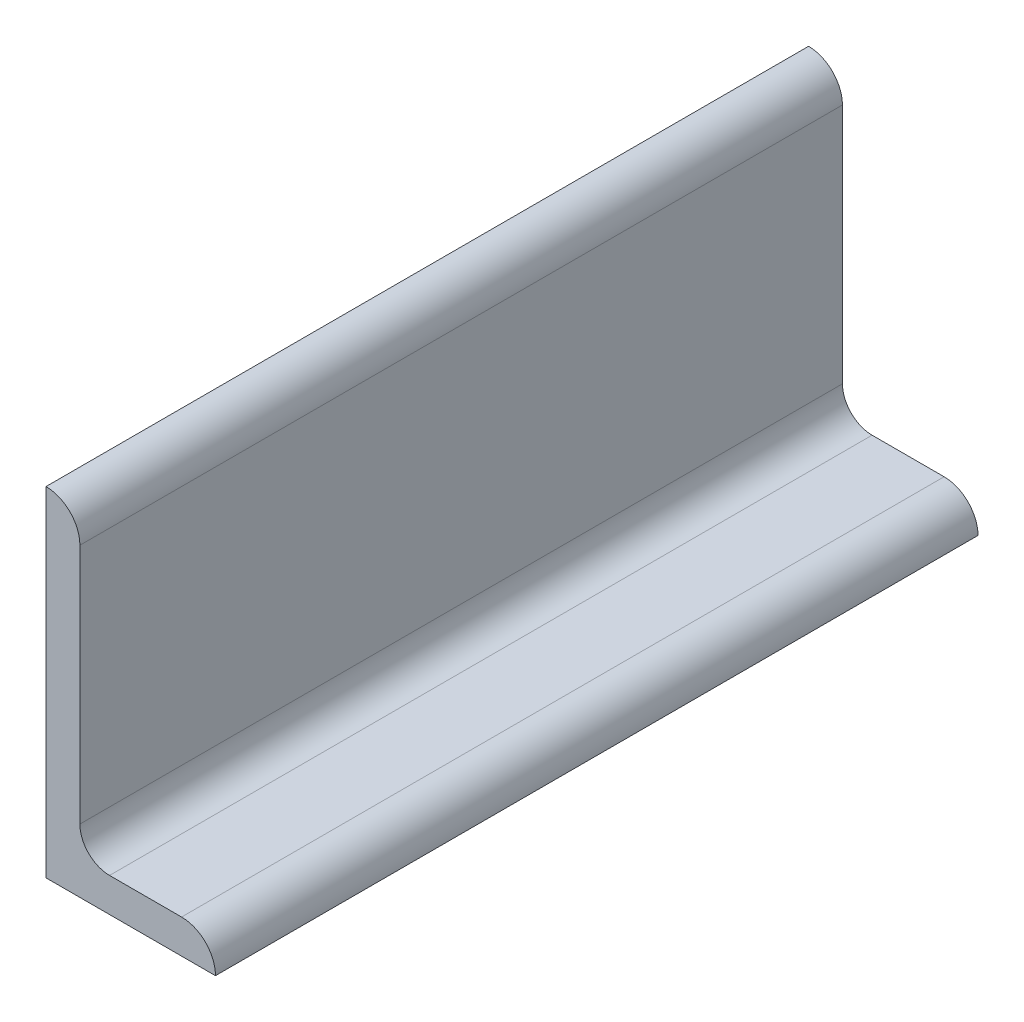
ISO-10303-21;
HEADER;
FILE_DESCRIPTION(('STEP AP214'),'2;1');
FILE_NAME('part.step','',(''),(''),'','','');
FILE_SCHEMA(('AUTOMOTIVE_DESIGN { 1 0 10303 214 1 1 1 1 }'));
ENDSEC;
DATA;
#1=APPLICATION_CONTEXT('core data for automotive mechanical design processes');
#2=APPLICATION_PROTOCOL_DEFINITION('international standard','automotive_design',2000,#1);
#3=PRODUCT_CONTEXT('',#1,'mechanical');
#4=PRODUCT('Part','Part','',(#3));
#5=PRODUCT_RELATED_PRODUCT_CATEGORY('part','',(#4));
#6=PRODUCT_DEFINITION_FORMATION('','',#4);
#7=PRODUCT_DEFINITION_CONTEXT('part definition',#1,'design');
#8=PRODUCT_DEFINITION('design','',#6,#7);
#9=PRODUCT_DEFINITION_SHAPE('','',#8);
#10=(LENGTH_UNIT() NAMED_UNIT(*) SI_UNIT(.MILLI.,.METRE.));
#11=(NAMED_UNIT(*) PLANE_ANGLE_UNIT() SI_UNIT($,.RADIAN.));
#12=(NAMED_UNIT(*) SI_UNIT($,.STERADIAN.) SOLID_ANGLE_UNIT());
#13=UNCERTAINTY_MEASURE_WITH_UNIT(LENGTH_MEASURE(1.E-05),#10,'distance_accuracy_value','');
#14=(GEOMETRIC_REPRESENTATION_CONTEXT(3) GLOBAL_UNCERTAINTY_ASSIGNED_CONTEXT((#13)) GLOBAL_UNIT_ASSIGNED_CONTEXT((#10,
#11,#12)) REPRESENTATION_CONTEXT('',''));
#15=CARTESIAN_POINT('',(0.,0.,0.));
#16=DIRECTION('',(0.,0.,1.));
#17=DIRECTION('',(1.,0.,0.));
#18=AXIS2_PLACEMENT_3D('',#15,#16,#17);
#19=CARTESIAN_POINT('',(40.,0.,90.));
#20=DIRECTION('',(0.,1.,0.));
#21=DIRECTION('',(-1.,0.,0.));
#22=AXIS2_PLACEMENT_3D('',#19,#20,#21);
#23=PLANE('',#22);
#24=DIRECTION('',(1.,0.,0.));
#25=VECTOR('',#24,1.);
#26=CARTESIAN_POINT('',(40.,0.,-90.));
#27=LINE('',#26,#25);
#28=CARTESIAN_POINT('',(0.,0.,-90.));
#29=VERTEX_POINT('',#28);
#30=CARTESIAN_POINT('',(40.,0.,-90.));
#31=VERTEX_POINT('',#30);
#32=EDGE_CURVE('E108',#29,#31,#27,.T.);
#33=ORIENTED_EDGE('',*,*,#32,.T.);
#34=DIRECTION('',(0.,0.,-1.));
#35=VECTOR('',#34,1.);
#36=CARTESIAN_POINT('',(40.,0.,90.));
#37=LINE('',#36,#35);
#38=CARTESIAN_POINT('',(40.,0.,90.));
#39=VERTEX_POINT('',#38);
#40=EDGE_CURVE('E106',#39,#31,#37,.T.);
#41=ORIENTED_EDGE('',*,*,#40,.F.);
#42=DIRECTION('',(1.,0.,0.));
#43=VECTOR('',#42,1.);
#44=CARTESIAN_POINT('',(40.,0.,90.));
#45=LINE('',#44,#43);
#46=CARTESIAN_POINT('',(0.,0.,90.));
#47=VERTEX_POINT('',#46);
#48=EDGE_CURVE('E93',#47,#39,#45,.T.);
#49=ORIENTED_EDGE('',*,*,#48,.F.);
#50=DIRECTION('',(0.,0.,-1.));
#51=VECTOR('',#50,1.);
#52=CARTESIAN_POINT('',(0.,0.,90.));
#53=LINE('',#52,#51);
#54=EDGE_CURVE('E128',#47,#29,#53,.T.);
#55=ORIENTED_EDGE('',*,*,#54,.T.);
#56=EDGE_LOOP('',(#33,#41,#49,#55));
#57=FACE_BOUND('',#56,.T.);
#58=ADVANCED_FACE('F34',(#57),#23,.F.);
#59=CARTESIAN_POINT('',(15.,8.,90.));
#60=DIRECTION('',(0.,-1.,0.));
#61=DIRECTION('',(1.,0.,0.));
#62=AXIS2_PLACEMENT_3D('',#59,#60,#61);
#63=PLANE('',#62);
#64=DIRECTION('',(-1.,0.,0.));
#65=VECTOR('',#64,1.);
#66=CARTESIAN_POINT('',(15.,8.,90.));
#67=LINE('',#66,#65);
#68=CARTESIAN_POINT('',(32.,8.,90.));
#69=VERTEX_POINT('',#68);
#70=CARTESIAN_POINT('',(15.,8.,90.));
#71=VERTEX_POINT('',#70);
#72=EDGE_CURVE('E101',#69,#71,#67,.T.);
#73=ORIENTED_EDGE('',*,*,#72,.F.);
#74=DIRECTION('',(0.,0.,-1.));
#75=VECTOR('',#74,1.);
#76=CARTESIAN_POINT('',(32.,8.,90.));
#77=LINE('',#76,#75);
#78=CARTESIAN_POINT('',(32.,8.,-90.));
#79=VERTEX_POINT('',#78);
#80=EDGE_CURVE('E11',#69,#79,#77,.T.);
#81=ORIENTED_EDGE('',*,*,#80,.T.);
#82=DIRECTION('',(-1.,0.,0.));
#83=VECTOR('',#82,1.);
#84=CARTESIAN_POINT('',(15.,8.,-90.));
#85=LINE('',#84,#83);
#86=CARTESIAN_POINT('',(15.,8.,-90.));
#87=VERTEX_POINT('',#86);
#88=EDGE_CURVE('E135',#79,#87,#85,.T.);
#89=ORIENTED_EDGE('',*,*,#88,.T.);
#90=DIRECTION('',(0.,0.,-1.));
#91=VECTOR('',#90,1.);
#92=CARTESIAN_POINT('',(15.,8.,90.));
#93=LINE('',#92,#91);
#94=EDGE_CURVE('E111',#71,#87,#93,.T.);
#95=ORIENTED_EDGE('',*,*,#94,.F.);
#96=EDGE_LOOP('',(#73,#81,#89,#95));
#97=FACE_BOUND('',#96,.T.);
#98=ADVANCED_FACE('F147',(#97),#63,.F.);
#99=CARTESIAN_POINT('',(15.,15.,90.));
#100=DIRECTION('',(0.,0.,-1.));
#101=DIRECTION('',(-1.,0.,0.));
#102=AXIS2_PLACEMENT_3D('',#99,#100,#101);
#103=CYLINDRICAL_SURFACE('',#102,7.);
#104=CARTESIAN_POINT('',(15.,15.,-90.));
#105=DIRECTION('',(0.,0.,-1.));
#106=DIRECTION('',(-1.,0.,0.));
#107=AXIS2_PLACEMENT_3D('',#104,#105,#106);
#108=CIRCLE('',#107,7.);
#109=CARTESIAN_POINT('',(8.,15.,-90.));
#110=VERTEX_POINT('',#109);
#111=EDGE_CURVE('E133',#87,#110,#108,.T.);
#112=ORIENTED_EDGE('',*,*,#111,.T.);
#113=DIRECTION('',(0.,0.,-1.));
#114=VECTOR('',#113,1.);
#115=CARTESIAN_POINT('',(8.,15.,90.));
#116=LINE('',#115,#114);
#117=CARTESIAN_POINT('',(8.,15.,90.));
#118=VERTEX_POINT('',#117);
#119=EDGE_CURVE('E122',#118,#110,#116,.T.);
#120=ORIENTED_EDGE('',*,*,#119,.F.);
#121=CARTESIAN_POINT('',(15.,15.,90.));
#122=DIRECTION('',(0.,0.,-1.));
#123=DIRECTION('',(-1.,0.,0.));
#124=AXIS2_PLACEMENT_3D('',#121,#122,#123);
#125=CIRCLE('',#124,7.);
#126=EDGE_CURVE('E141',#71,#118,#125,.T.);
#127=ORIENTED_EDGE('',*,*,#126,.F.);
#128=ORIENTED_EDGE('',*,*,#94,.T.);
#129=EDGE_LOOP('',(#112,#120,#127,#128));
#130=FACE_BOUND('',#129,.T.);
#131=ADVANCED_FACE('F151',(#130),#103,.F.);
#132=CARTESIAN_POINT('',(7.99999999999999,80.,90.));
#133=DIRECTION('',(-1.,0.,0.));
#134=DIRECTION('',(0.,-1.,0.));
#135=AXIS2_PLACEMENT_3D('',#132,#133,#134);
#136=PLANE('',#135);
#137=DIRECTION('',(0.,1.,0.));
#138=VECTOR('',#137,1.);
#139=CARTESIAN_POINT('',(7.99999999999999,80.,-90.));
#140=LINE('',#139,#138);
#141=CARTESIAN_POINT('',(7.99999999999999,72.,-90.));
#142=VERTEX_POINT('',#141);
#143=EDGE_CURVE('E131',#110,#142,#140,.T.);
#144=ORIENTED_EDGE('',*,*,#143,.T.);
#145=DIRECTION('',(0.,0.,-1.));
#146=VECTOR('',#145,1.);
#147=CARTESIAN_POINT('',(7.99999999999999,72.,90.));
#148=LINE('',#147,#146);
#149=CARTESIAN_POINT('',(7.99999999999999,72.,90.));
#150=VERTEX_POINT('',#149);
#151=EDGE_CURVE('E57',#142,#150,#148,.F.);
#152=ORIENTED_EDGE('',*,*,#151,.T.);
#153=DIRECTION('',(0.,1.,0.));
#154=VECTOR('',#153,1.);
#155=CARTESIAN_POINT('',(7.99999999999999,80.,90.));
#156=LINE('',#155,#154);
#157=EDGE_CURVE('E139',#118,#150,#156,.T.);
#158=ORIENTED_EDGE('',*,*,#157,.F.);
#159=ORIENTED_EDGE('',*,*,#119,.T.);
#160=EDGE_LOOP('',(#144,#152,#158,#159));
#161=FACE_BOUND('',#160,.T.);
#162=ADVANCED_FACE('F153',(#161),#136,.F.);
#163=CARTESIAN_POINT('',(0.,80.,90.));
#164=DIRECTION('',(1.,0.,0.));
#165=DIRECTION('',(0.,1.,0.));
#166=AXIS2_PLACEMENT_3D('',#163,#164,#165);
#167=PLANE('',#166);
#168=DIRECTION('',(0.,-1.,0.));
#169=VECTOR('',#168,1.);
#170=CARTESIAN_POINT('',(0.,80.,-90.));
#171=LINE('',#170,#169);
#172=CARTESIAN_POINT('',(0.,80.,-90.));
#173=VERTEX_POINT('',#172);
#174=EDGE_CURVE('E102',#173,#29,#171,.T.);
#175=ORIENTED_EDGE('',*,*,#174,.T.);
#176=ORIENTED_EDGE('',*,*,#54,.F.);
#177=DIRECTION('',(0.,-1.,0.));
#178=VECTOR('',#177,1.);
#179=CARTESIAN_POINT('',(0.,80.,90.));
#180=LINE('',#179,#178);
#181=CARTESIAN_POINT('',(0.,80.,90.));
#182=VERTEX_POINT('',#181);
#183=EDGE_CURVE('E97',#182,#47,#180,.T.);
#184=ORIENTED_EDGE('',*,*,#183,.F.);
#185=DIRECTION('',(0.,0.,-1.));
#186=VECTOR('',#185,1.);
#187=CARTESIAN_POINT('',(0.,80.,90.));
#188=LINE('',#187,#186);
#189=EDGE_CURVE('E125',#182,#173,#188,.T.);
#190=ORIENTED_EDGE('',*,*,#189,.T.);
#191=EDGE_LOOP('',(#175,#176,#184,#190));
#192=FACE_BOUND('',#191,.T.);
#193=ADVANCED_FACE('F160',(#192),#167,.F.);
#194=CARTESIAN_POINT('',(15.,15.,90.));
#195=DIRECTION('',(0.,0.,-1.));
#196=DIRECTION('',(-1.,0.,0.));
#197=AXIS2_PLACEMENT_3D('',#194,#195,#196);
#198=PLANE('',#197);
#199=ORIENTED_EDGE('',*,*,#157,.T.);
#200=CARTESIAN_POINT('',(0.,72.,90.));
#201=DIRECTION('',(0.,0.,-1.));
#202=DIRECTION('',(-1.,0.,0.));
#203=AXIS2_PLACEMENT_3D('',#200,#201,#202);
#204=CIRCLE('',#203,8.);
#205=EDGE_CURVE('E42',#150,#182,#204,.F.);
#206=ORIENTED_EDGE('',*,*,#205,.T.);
#207=ORIENTED_EDGE('',*,*,#183,.T.);
#208=ORIENTED_EDGE('',*,*,#48,.T.);
#209=CARTESIAN_POINT('',(32.,0.,90.));
#210=DIRECTION('',(0.,0.,-1.));
#211=DIRECTION('',(-1.,0.,0.));
#212=AXIS2_PLACEMENT_3D('',#209,#210,#211);
#213=CIRCLE('',#212,8.);
#214=EDGE_CURVE('E49',#39,#69,#213,.F.);
#215=ORIENTED_EDGE('',*,*,#214,.T.);
#216=ORIENTED_EDGE('',*,*,#72,.T.);
#217=ORIENTED_EDGE('',*,*,#126,.T.);
#218=EDGE_LOOP('',(#199,#206,#207,#208,#215,#216,#217));
#219=FACE_BOUND('',#218,.T.);
#220=ADVANCED_FACE('F95',(#219),#198,.F.);
#221=CARTESIAN_POINT('',(15.,15.,-90.));
#222=DIRECTION('',(0.,0.,-1.));
#223=DIRECTION('',(-1.,0.,0.));
#224=AXIS2_PLACEMENT_3D('',#221,#222,#223);
#225=PLANE('',#224);
#226=ORIENTED_EDGE('',*,*,#174,.F.);
#227=CARTESIAN_POINT('',(0.,72.,-90.));
#228=DIRECTION('',(0.,0.,-1.));
#229=DIRECTION('',(-1.,0.,0.));
#230=AXIS2_PLACEMENT_3D('',#227,#228,#229);
#231=CIRCLE('',#230,8.);
#232=EDGE_CURVE('E115',#173,#142,#231,.T.);
#233=ORIENTED_EDGE('',*,*,#232,.T.);
#234=ORIENTED_EDGE('',*,*,#143,.F.);
#235=ORIENTED_EDGE('',*,*,#111,.F.);
#236=ORIENTED_EDGE('',*,*,#88,.F.);
#237=CARTESIAN_POINT('',(32.,0.,-90.));
#238=DIRECTION('',(0.,0.,-1.));
#239=DIRECTION('',(-1.,0.,0.));
#240=AXIS2_PLACEMENT_3D('',#237,#238,#239);
#241=CIRCLE('',#240,8.);
#242=EDGE_CURVE('E110',#79,#31,#241,.T.);
#243=ORIENTED_EDGE('',*,*,#242,.T.);
#244=ORIENTED_EDGE('',*,*,#32,.F.);
#245=EDGE_LOOP('',(#226,#233,#234,#235,#236,#243,#244));
#246=FACE_BOUND('',#245,.T.);
#247=ADVANCED_FACE('F162',(#246),#225,.T.);
#248=CARTESIAN_POINT('',(0.,72.,90.));
#249=DIRECTION('',(0.,0.,-1.));
#250=DIRECTION('',(-1.,0.,0.));
#251=AXIS2_PLACEMENT_3D('',#248,#249,#250);
#252=CYLINDRICAL_SURFACE('',#251,8.);
#253=ORIENTED_EDGE('',*,*,#205,.F.);
#254=ORIENTED_EDGE('',*,*,#151,.F.);
#255=ORIENTED_EDGE('',*,*,#232,.F.);
#256=ORIENTED_EDGE('',*,*,#189,.F.);
#257=EDGE_LOOP('',(#253,#254,#255,#256));
#258=FACE_BOUND('',#257,.T.);
#259=ADVANCED_FACE('F157',(#258),#252,.T.);
#260=CARTESIAN_POINT('',(32.,0.,90.));
#261=DIRECTION('',(0.,0.,-1.));
#262=DIRECTION('',(-1.,0.,0.));
#263=AXIS2_PLACEMENT_3D('',#260,#261,#262);
#264=CYLINDRICAL_SURFACE('',#263,8.);
#265=ORIENTED_EDGE('',*,*,#214,.F.);
#266=ORIENTED_EDGE('',*,*,#40,.T.);
#267=ORIENTED_EDGE('',*,*,#242,.F.);
#268=ORIENTED_EDGE('',*,*,#80,.F.);
#269=EDGE_LOOP('',(#265,#266,#267,#268));
#270=FACE_BOUND('',#269,.T.);
#271=ADVANCED_FACE('F36',(#270),#264,.T.);
#272=CLOSED_SHELL('',(#58,#98,#131,#162,#193,#220,#247,#259,#271));
#273=MANIFOLD_SOLID_BREP('B2',#272);
#274=ADVANCED_BREP_SHAPE_REPRESENTATION('',(#18,#273),#14);
#275=SHAPE_DEFINITION_REPRESENTATION(#9,#274);
ENDSEC;
END-ISO-10303-21;
